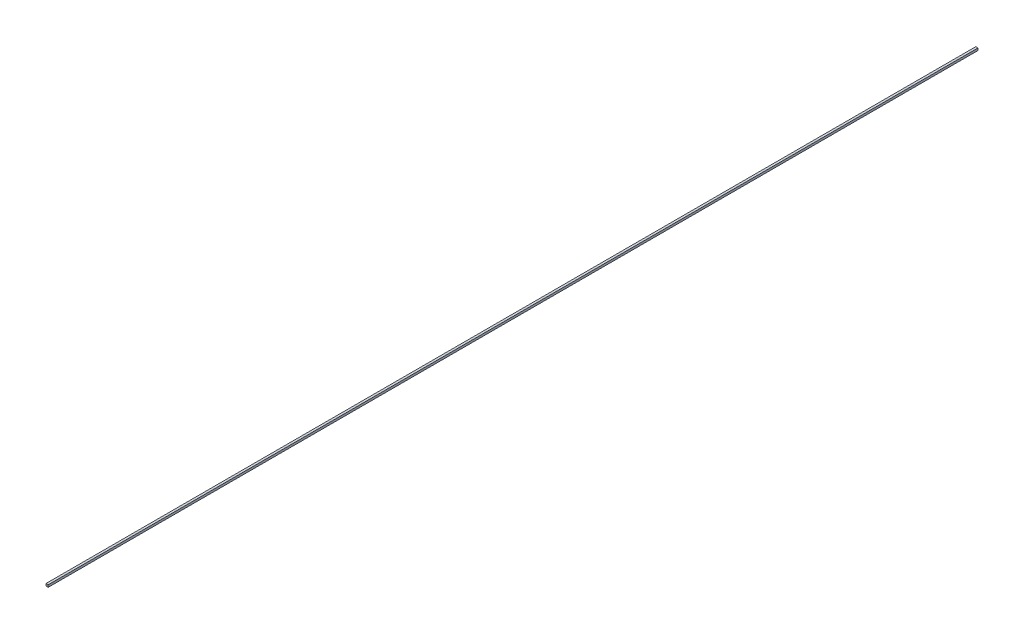
ISO-10303-21;
HEADER;
FILE_DESCRIPTION(('STEP AP214'),'2;1');
FILE_NAME('part.step','',(''),(''),'','','');
FILE_SCHEMA(('AUTOMOTIVE_DESIGN { 1 0 10303 214 1 1 1 1 }'));
ENDSEC;
DATA;
#1=APPLICATION_CONTEXT('core data for automotive mechanical design processes');
#2=APPLICATION_PROTOCOL_DEFINITION('international standard','automotive_design',2000,#1);
#3=PRODUCT_CONTEXT('',#1,'mechanical');
#4=PRODUCT('Part','Part','',(#3));
#5=PRODUCT_RELATED_PRODUCT_CATEGORY('part','',(#4));
#6=PRODUCT_DEFINITION_FORMATION('','',#4);
#7=PRODUCT_DEFINITION_CONTEXT('part definition',#1,'design');
#8=PRODUCT_DEFINITION('design','',#6,#7);
#9=PRODUCT_DEFINITION_SHAPE('','',#8);
#10=(LENGTH_UNIT() NAMED_UNIT(*) SI_UNIT(.MILLI.,.METRE.));
#11=(NAMED_UNIT(*) PLANE_ANGLE_UNIT() SI_UNIT($,.RADIAN.));
#12=(NAMED_UNIT(*) SI_UNIT($,.STERADIAN.) SOLID_ANGLE_UNIT());
#13=UNCERTAINTY_MEASURE_WITH_UNIT(LENGTH_MEASURE(1.E-05),#10,'distance_accuracy_value','');
#14=(GEOMETRIC_REPRESENTATION_CONTEXT(3) GLOBAL_UNCERTAINTY_ASSIGNED_CONTEXT((#13)) GLOBAL_UNIT_ASSIGNED_CONTEXT((#10,
#11,#12)) REPRESENTATION_CONTEXT('',''));
#15=CARTESIAN_POINT('',(0.,0.,0.));
#16=DIRECTION('',(0.,0.,1.));
#17=DIRECTION('',(1.,0.,0.));
#18=AXIS2_PLACEMENT_3D('',#15,#16,#17);
#19=CARTESIAN_POINT('',(0.00100076,0.00100076,0.));
#20=DIRECTION('',(1.,0.,0.));
#21=DIRECTION('',(0.,0.,-1.));
#22=AXIS2_PLACEMENT_3D('',#19,#20,#21);
#23=PLANE('',#22);
#24=DIRECTION('',(0.,0.,-1.));
#25=VECTOR('',#24,1.);
#26=CARTESIAN_POINT('',(0.00100076,0.,0.));
#27=LINE('',#26,#25);
#28=CARTESIAN_POINT('',(0.00100076,0.,0.));
#29=VERTEX_POINT('',#28);
#30=CARTESIAN_POINT('',(0.00100076,0.,0.41656));
#31=VERTEX_POINT('',#30);
#32=EDGE_CURVE('E62',#29,#31,#27,.F.);
#33=ORIENTED_EDGE('',*,*,#32,.F.);
#34=DIRECTION('',(0.,1.,0.));
#35=VECTOR('',#34,1.);
#36=CARTESIAN_POINT('',(0.00100076,0.00100076,0.));
#37=LINE('',#36,#35);
#38=CARTESIAN_POINT('',(0.00100076,0.00100076,0.));
#39=VERTEX_POINT('',#38);
#40=EDGE_CURVE('E76',#29,#39,#37,.T.);
#41=ORIENTED_EDGE('',*,*,#40,.T.);
#42=DIRECTION('',(0.,0.,1.));
#43=VECTOR('',#42,1.);
#44=CARTESIAN_POINT('',(0.00100076,0.00100076,0.));
#45=LINE('',#44,#43);
#46=CARTESIAN_POINT('',(0.00100076,0.00100076,0.41656));
#47=VERTEX_POINT('',#46);
#48=EDGE_CURVE('E80',#47,#39,#45,.F.);
#49=ORIENTED_EDGE('',*,*,#48,.F.);
#50=DIRECTION('',(0.,1.,0.));
#51=VECTOR('',#50,1.);
#52=CARTESIAN_POINT('',(0.00100076,0.,0.41656));
#53=LINE('',#52,#51);
#54=EDGE_CURVE('E65',#31,#47,#53,.T.);
#55=ORIENTED_EDGE('',*,*,#54,.F.);
#56=EDGE_LOOP('',(#33,#41,#49,#55));
#57=FACE_BOUND('',#56,.T.);
#58=ADVANCED_FACE('F17',(#57),#23,.T.);
#59=CARTESIAN_POINT('',(0.00100076,0.,0.));
#60=DIRECTION('',(0.,-1.,0.));
#61=DIRECTION('',(0.,0.,-1.));
#62=AXIS2_PLACEMENT_3D('',#59,#60,#61);
#63=PLANE('',#62);
#64=DIRECTION('',(0.,0.,1.));
#65=VECTOR('',#64,1.);
#66=CARTESIAN_POINT('',(0.,0.,0.));
#67=LINE('',#66,#65);
#68=CARTESIAN_POINT('',(0.,0.,0.));
#69=VERTEX_POINT('',#68);
#70=CARTESIAN_POINT('',(0.,0.,0.41656));
#71=VERTEX_POINT('',#70);
#72=EDGE_CURVE('E60',#69,#71,#67,.T.);
#73=ORIENTED_EDGE('',*,*,#72,.F.);
#74=DIRECTION('',(1.,0.,0.));
#75=VECTOR('',#74,1.);
#76=CARTESIAN_POINT('',(0.00100076,0.,0.));
#77=LINE('',#76,#75);
#78=EDGE_CURVE('E82',#69,#29,#77,.T.);
#79=ORIENTED_EDGE('',*,*,#78,.T.);
#80=ORIENTED_EDGE('',*,*,#32,.T.);
#81=DIRECTION('',(1.,0.,0.));
#82=VECTOR('',#81,1.);
#83=CARTESIAN_POINT('',(0.,0.,0.41656));
#84=LINE('',#83,#82);
#85=EDGE_CURVE('E20',#71,#31,#84,.T.);
#86=ORIENTED_EDGE('',*,*,#85,.F.);
#87=EDGE_LOOP('',(#73,#79,#80,#86));
#88=FACE_BOUND('',#87,.T.);
#89=ADVANCED_FACE('F57',(#88),#63,.T.);
#90=CARTESIAN_POINT('',(0.,0.,0.41656));
#91=DIRECTION('',(0.,0.,1.));
#92=DIRECTION('',(1.,0.,0.));
#93=AXIS2_PLACEMENT_3D('',#90,#91,#92);
#94=PLANE('',#93);
#95=DIRECTION('',(1.,0.,0.));
#96=VECTOR('',#95,1.);
#97=CARTESIAN_POINT('',(0.,0.00100076,0.41656));
#98=LINE('',#97,#96);
#99=CARTESIAN_POINT('',(0.,0.00100076,0.41656));
#100=VERTEX_POINT('',#99);
#101=EDGE_CURVE('E70',#100,#47,#98,.T.);
#102=ORIENTED_EDGE('',*,*,#101,.F.);
#103=DIRECTION('',(0.,1.,0.));
#104=VECTOR('',#103,1.);
#105=CARTESIAN_POINT('',(0.,0.,0.41656));
#106=LINE('',#105,#104);
#107=EDGE_CURVE('E67',#71,#100,#106,.T.);
#108=ORIENTED_EDGE('',*,*,#107,.F.);
#109=ORIENTED_EDGE('',*,*,#85,.T.);
#110=ORIENTED_EDGE('',*,*,#54,.T.);
#111=EDGE_LOOP('',(#102,#108,#109,#110));
#112=FACE_BOUND('',#111,.T.);
#113=ADVANCED_FACE('F68',(#112),#94,.T.);
#114=CARTESIAN_POINT('',(0.,0.00100076,0.));
#115=DIRECTION('',(0.,1.,0.));
#116=DIRECTION('',(0.,0.,1.));
#117=AXIS2_PLACEMENT_3D('',#114,#115,#116);
#118=PLANE('',#117);
#119=ORIENTED_EDGE('',*,*,#48,.T.);
#120=DIRECTION('',(1.,0.,0.));
#121=VECTOR('',#120,1.);
#122=CARTESIAN_POINT('',(0.,0.00100076,0.));
#123=LINE('',#122,#121);
#124=CARTESIAN_POINT('',(0.,0.00100076,0.));
#125=VERTEX_POINT('',#124);
#126=EDGE_CURVE('E35',#39,#125,#123,.F.);
#127=ORIENTED_EDGE('',*,*,#126,.T.);
#128=DIRECTION('',(0.,0.,1.));
#129=VECTOR('',#128,1.);
#130=CARTESIAN_POINT('',(0.,0.00100076,0.));
#131=LINE('',#130,#129);
#132=EDGE_CURVE('E26',#100,#125,#131,.F.);
#133=ORIENTED_EDGE('',*,*,#132,.F.);
#134=ORIENTED_EDGE('',*,*,#101,.T.);
#135=EDGE_LOOP('',(#119,#127,#133,#134));
#136=FACE_BOUND('',#135,.T.);
#137=ADVANCED_FACE('F89',(#136),#118,.T.);
#138=CARTESIAN_POINT('',(0.,0.,0.));
#139=DIRECTION('',(0.,0.,1.));
#140=DIRECTION('',(1.,0.,0.));
#141=AXIS2_PLACEMENT_3D('',#138,#139,#140);
#142=PLANE('',#141);
#143=ORIENTED_EDGE('',*,*,#126,.F.);
#144=ORIENTED_EDGE('',*,*,#40,.F.);
#145=ORIENTED_EDGE('',*,*,#78,.F.);
#146=DIRECTION('',(0.,1.,0.));
#147=VECTOR('',#146,1.);
#148=CARTESIAN_POINT('',(0.,0.,0.));
#149=LINE('',#148,#147);
#150=EDGE_CURVE('E11',#125,#69,#149,.F.);
#151=ORIENTED_EDGE('',*,*,#150,.F.);
#152=EDGE_LOOP('',(#143,#144,#145,#151));
#153=FACE_BOUND('',#152,.T.);
#154=ADVANCED_FACE('F91',(#153),#142,.F.);
#155=CARTESIAN_POINT('',(0.,0.,0.));
#156=DIRECTION('',(-1.,0.,0.));
#157=DIRECTION('',(0.,0.,1.));
#158=AXIS2_PLACEMENT_3D('',#155,#156,#157);
#159=PLANE('',#158);
#160=ORIENTED_EDGE('',*,*,#132,.T.);
#161=ORIENTED_EDGE('',*,*,#150,.T.);
#162=ORIENTED_EDGE('',*,*,#72,.T.);
#163=ORIENTED_EDGE('',*,*,#107,.T.);
#164=EDGE_LOOP('',(#160,#161,#162,#163));
#165=FACE_BOUND('',#164,.T.);
#166=ADVANCED_FACE('F74',(#165),#159,.T.);
#167=CLOSED_SHELL('',(#58,#89,#113,#137,#154,#166));
#168=MANIFOLD_SOLID_BREP('B1',#167);
#169=ADVANCED_BREP_SHAPE_REPRESENTATION('',(#18,#168),#14);
#170=SHAPE_DEFINITION_REPRESENTATION(#9,#169);
ENDSEC;
END-ISO-10303-21;
